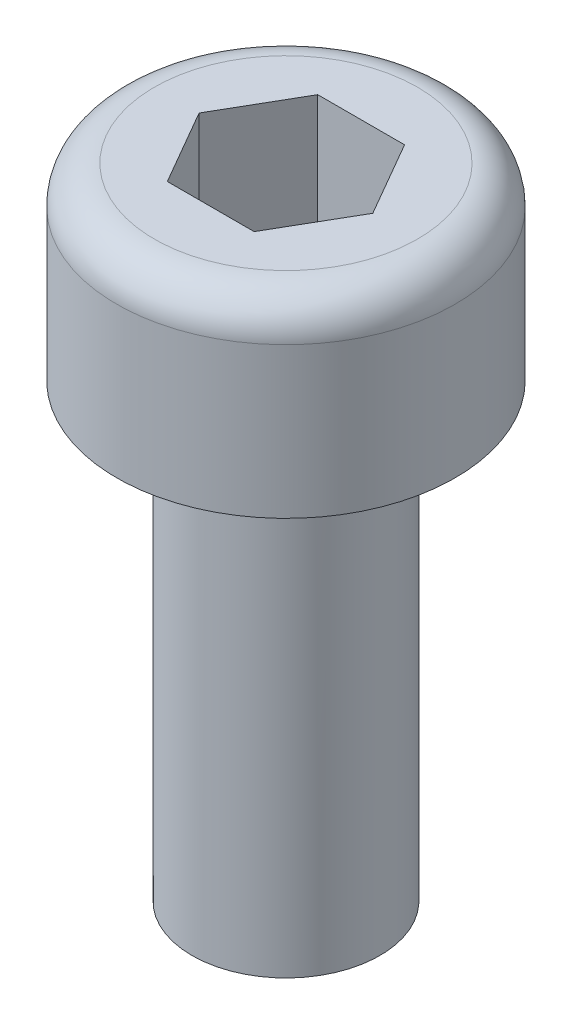
ISO-10303-21;
HEADER;
FILE_DESCRIPTION(('STEP AP214'),'2;1');
FILE_NAME('part.step','',(''),(''),'','','');
FILE_SCHEMA(('AUTOMOTIVE_DESIGN { 1 0 10303 214 1 1 1 1 }'));
ENDSEC;
DATA;
#1=APPLICATION_CONTEXT('core data for automotive mechanical design processes');
#2=APPLICATION_PROTOCOL_DEFINITION('international standard','automotive_design',2000,#1);
#3=PRODUCT_CONTEXT('',#1,'mechanical');
#4=PRODUCT('Part','Part','',(#3));
#5=PRODUCT_RELATED_PRODUCT_CATEGORY('part','',(#4));
#6=PRODUCT_DEFINITION_FORMATION('','',#4);
#7=PRODUCT_DEFINITION_CONTEXT('part definition',#1,'design');
#8=PRODUCT_DEFINITION('design','',#6,#7);
#9=PRODUCT_DEFINITION_SHAPE('','',#8);
#10=(LENGTH_UNIT() NAMED_UNIT(*) SI_UNIT(.MILLI.,.METRE.));
#11=(NAMED_UNIT(*) PLANE_ANGLE_UNIT() SI_UNIT($,.RADIAN.));
#12=(NAMED_UNIT(*) SI_UNIT($,.STERADIAN.) SOLID_ANGLE_UNIT());
#13=UNCERTAINTY_MEASURE_WITH_UNIT(LENGTH_MEASURE(1.E-05),#10,'distance_accuracy_value','');
#14=(GEOMETRIC_REPRESENTATION_CONTEXT(3) GLOBAL_UNCERTAINTY_ASSIGNED_CONTEXT((#13)) GLOBAL_UNIT_ASSIGNED_CONTEXT((#10,
#11,#12)) REPRESENTATION_CONTEXT('',''));
#15=CARTESIAN_POINT('',(0.,0.,0.));
#16=DIRECTION('',(0.,0.,1.));
#17=DIRECTION('',(1.,0.,0.));
#18=AXIS2_PLACEMENT_3D('',#15,#16,#17);
#19=CARTESIAN_POINT('',(0.,2.,0.));
#20=DIRECTION('',(0.,-1.00000000000001,0.));
#21=DIRECTION('',(0.,0.,-0.999999999999998));
#22=AXIS2_PLACEMENT_3D('',#19,#20,#21);
#23=TOROIDAL_SURFACE('',#22,1.75,0.5);
#24=CARTESIAN_POINT('',(0.,2.5,0.));
#25=DIRECTION('',(0.,-1.00000000000001,0.));
#26=DIRECTION('',(0.,0.,-0.999999999999998));
#27=AXIS2_PLACEMENT_3D('',#24,#25,#26);
#28=CIRCLE('',#27,1.75);
#29=CARTESIAN_POINT('',(0.,2.5,-1.75));
#30=VERTEX_POINT('',#29);
#31=EDGE_CURVE('E136',#30,#30,#28,.T.);
#32=ORIENTED_EDGE('',*,*,#31,.T.);
#33=EDGE_LOOP('',(#32));
#34=FACE_BOUND('',#33,.T.);
#35=CARTESIAN_POINT('',(0.,2.,0.));
#36=DIRECTION('',(0.,-1.00000000000001,0.));
#37=DIRECTION('',(0.,0.,-0.999999999999998));
#38=AXIS2_PLACEMENT_3D('',#35,#36,#37);
#39=CIRCLE('',#38,2.25);
#40=CARTESIAN_POINT('',(0.,2.,-2.24999999999999));
#41=VERTEX_POINT('',#40);
#42=EDGE_CURVE('E11',#41,#41,#39,.T.);
#43=ORIENTED_EDGE('',*,*,#42,.F.);
#44=EDGE_LOOP('',(#43));
#45=FACE_BOUND('',#44,.T.);
#46=ADVANCED_FACE('F33',(#34,#45),#23,.T.);
#47=CARTESIAN_POINT('',(0.,2.5,0.));
#48=DIRECTION('',(0.,-1.00000000000001,0.));
#49=DIRECTION('',(0.,0.,-0.999999999999998));
#50=AXIS2_PLACEMENT_3D('',#47,#48,#49);
#51=CYLINDRICAL_SURFACE('',#50,2.25);
#52=ORIENTED_EDGE('',*,*,#42,.T.);
#53=EDGE_LOOP('',(#52));
#54=FACE_BOUND('',#53,.T.);
#55=CARTESIAN_POINT('',(0.,0.,0.));
#56=DIRECTION('',(0.,-1.00000000000001,0.));
#57=DIRECTION('',(0.,0.,-0.999999999999998));
#58=AXIS2_PLACEMENT_3D('',#55,#56,#57);
#59=CIRCLE('',#58,2.25);
#60=CARTESIAN_POINT('',(0.,0.,-2.24999999999999));
#61=VERTEX_POINT('',#60);
#62=EDGE_CURVE('E40',#61,#61,#59,.T.);
#63=ORIENTED_EDGE('',*,*,#62,.F.);
#64=EDGE_LOOP('',(#63));
#65=FACE_BOUND('',#64,.T.);
#66=ADVANCED_FACE('F156',(#54,#65),#51,.T.);
#67=CARTESIAN_POINT('',(2.24999999999999,0.,0.));
#68=DIRECTION('',(0.,-1.00000000000001,0.));
#69=DIRECTION('',(0.,0.,-0.999999999999998));
#70=AXIS2_PLACEMENT_3D('',#67,#68,#69);
#71=PLANE('',#70);
#72=ORIENTED_EDGE('',*,*,#62,.T.);
#73=EDGE_LOOP('',(#72));
#74=FACE_BOUND('',#73,.T.);
#75=CARTESIAN_POINT('',(0.,0.,0.));
#76=DIRECTION('',(0.,-1.00000000000001,0.));
#77=DIRECTION('',(0.,0.,-0.999999999999998));
#78=AXIS2_PLACEMENT_3D('',#75,#76,#77);
#79=CIRCLE('',#78,1.25);
#80=CARTESIAN_POINT('',(0.,0.,-1.25));
#81=VERTEX_POINT('',#80);
#82=EDGE_CURVE('E148',#81,#81,#79,.T.);
#83=ORIENTED_EDGE('',*,*,#82,.F.);
#84=EDGE_LOOP('',(#83));
#85=FACE_BOUND('',#84,.T.);
#86=ADVANCED_FACE('F153',(#74,#85),#71,.T.);
#87=CARTESIAN_POINT('',(0.,2.5,0.));
#88=DIRECTION('',(0.,-1.00000000000001,0.));
#89=DIRECTION('',(0.,0.,-0.999999999999998));
#90=AXIS2_PLACEMENT_3D('',#87,#88,#89);
#91=CYLINDRICAL_SURFACE('',#90,1.25);
#92=ORIENTED_EDGE('',*,*,#82,.T.);
#93=EDGE_LOOP('',(#92));
#94=FACE_BOUND('',#93,.T.);
#95=CARTESIAN_POINT('',(0.,-6.00000000000014,0.));
#96=DIRECTION('',(0.,-1.00000000000001,0.));
#97=DIRECTION('',(0.,0.,-0.999999999999998));
#98=AXIS2_PLACEMENT_3D('',#95,#96,#97);
#99=CIRCLE('',#98,1.25);
#100=CARTESIAN_POINT('',(0.,-6.00000000000014,-1.25));
#101=VERTEX_POINT('',#100);
#102=EDGE_CURVE('E145',#101,#101,#99,.T.);
#103=ORIENTED_EDGE('',*,*,#102,.F.);
#104=EDGE_LOOP('',(#103));
#105=FACE_BOUND('',#104,.T.);
#106=ADVANCED_FACE('F163',(#94,#105),#91,.T.);
#107=CARTESIAN_POINT('',(0.,-6.33493649053905,0.));
#108=DIRECTION('',(0.,1.00000000000001,0.));
#109=DIRECTION('',(0.,0.,0.999999999999998));
#110=AXIS2_PLACEMENT_3D('',#107,#108,#109);
#111=CONICAL_SURFACE('',#110,0.,1.30899693899574);
#112=ORIENTED_EDGE('',*,*,#102,.T.);
#113=EDGE_LOOP('',(#112));
#114=FACE_BOUND('',#113,.T.);
#115=CARTESIAN_POINT('',(0.,-6.33493649053905,0.));
#116=VERTEX_POINT('',#115);
#117=VERTEX_LOOP('',#116);
#118=FACE_BOUND('',#117,.T.);
#119=ADVANCED_FACE('F169',(#114,#118),#111,.T.);
#120=CARTESIAN_POINT('',(0.,2.5,0.));
#121=DIRECTION('',(0.,1.00000000000001,0.));
#122=DIRECTION('',(0.,0.,0.999999999999998));
#123=AXIS2_PLACEMENT_3D('',#120,#121,#122);
#124=PLANE('',#123);
#125=DIRECTION('',(0.499999999999995,0.,-0.866025403784436));
#126=VECTOR('',#125,1.);
#127=CARTESIAN_POINT('',(0.577350269189604,2.5,0.999999999999985));
#128=LINE('',#127,#126);
#129=CARTESIAN_POINT('',(0.577350269189604,2.5,0.999999999999985));
#130=VERTEX_POINT('',#129);
#131=CARTESIAN_POINT('',(1.15470053837922,2.5,0.));
#132=VERTEX_POINT('',#131);
#133=EDGE_CURVE('E47',#130,#132,#128,.T.);
#134=ORIENTED_EDGE('',*,*,#133,.F.);
#135=DIRECTION('',(0.999999999999996,0.,0.));
#136=VECTOR('',#135,1.);
#137=CARTESIAN_POINT('',(-0.577350269189626,2.5,0.999999999999999));
#138=LINE('',#137,#136);
#139=CARTESIAN_POINT('',(-0.577350269189626,2.5,0.999999999999999));
#140=VERTEX_POINT('',#139);
#141=EDGE_CURVE('E116',#140,#130,#138,.T.);
#142=ORIENTED_EDGE('',*,*,#141,.F.);
#143=DIRECTION('',(0.5,0.,0.866025403784439));
#144=VECTOR('',#143,1.);
#145=CARTESIAN_POINT('',(-1.15470053837928,2.5,0.));
#146=LINE('',#145,#144);
#147=CARTESIAN_POINT('',(-1.15470053837928,2.5,0.));
#148=VERTEX_POINT('',#147);
#149=EDGE_CURVE('E110',#148,#140,#146,.T.);
#150=ORIENTED_EDGE('',*,*,#149,.F.);
#151=DIRECTION('',(-0.499999999999995,0.,0.866025403784436));
#152=VECTOR('',#151,1.);
#153=CARTESIAN_POINT('',(-0.577350269189626,2.5,-0.999999999999999));
#154=LINE('',#153,#152);
#155=CARTESIAN_POINT('',(-0.577350269189626,2.5,-0.999999999999999));
#156=VERTEX_POINT('',#155);
#157=EDGE_CURVE('E108',#156,#148,#154,.T.);
#158=ORIENTED_EDGE('',*,*,#157,.F.);
#159=DIRECTION('',(-0.999999999999996,0.,0.));
#160=VECTOR('',#159,1.);
#161=CARTESIAN_POINT('',(0.577350269189605,2.5,-1.));
#162=LINE('',#161,#160);
#163=CARTESIAN_POINT('',(0.577350269189605,2.5,-1.));
#164=VERTEX_POINT('',#163);
#165=EDGE_CURVE('E89',#164,#156,#162,.T.);
#166=ORIENTED_EDGE('',*,*,#165,.F.);
#167=DIRECTION('',(-0.5,0.,-0.866025403784438));
#168=VECTOR('',#167,1.);
#169=CARTESIAN_POINT('',(1.15470053837922,2.5,0.));
#170=LINE('',#169,#168);
#171=EDGE_CURVE('E100',#132,#164,#170,.T.);
#172=ORIENTED_EDGE('',*,*,#171,.F.);
#173=EDGE_LOOP('',(#134,#142,#150,#158,#166,#172));
#174=FACE_BOUND('',#173,.T.);
#175=ORIENTED_EDGE('',*,*,#31,.F.);
#176=EDGE_LOOP('',(#175));
#177=FACE_BOUND('',#176,.T.);
#178=ADVANCED_FACE('F104',(#174,#177),#124,.T.);
#179=CARTESIAN_POINT('',(0.577350269189628,0.5,0.999999999999966));
#180=DIRECTION('',(0.866025403784438,0.,0.500000000000002));
#181=DIRECTION('',(0.499999999999996,0.,-0.866025403784437));
#182=AXIS2_PLACEMENT_3D('',#179,#180,#181);
#183=PLANE('',#182);
#184=ORIENTED_EDGE('',*,*,#133,.T.);
#185=DIRECTION('',(0.,1.00000000000001,0.));
#186=VECTOR('',#185,1.);
#187=CARTESIAN_POINT('',(1.15470053837922,0.5,0.));
#188=LINE('',#187,#186);
#189=CARTESIAN_POINT('',(1.15470053837922,0.5,0.));
#190=VERTEX_POINT('',#189);
#191=EDGE_CURVE('E97',#190,#132,#188,.T.);
#192=ORIENTED_EDGE('',*,*,#191,.F.);
#193=DIRECTION('',(0.499999999999995,0.,-0.866025403784436));
#194=VECTOR('',#193,1.);
#195=CARTESIAN_POINT('',(0.577350269189628,0.5,0.999999999999966));
#196=LINE('',#195,#194);
#197=CARTESIAN_POINT('',(0.577350269189628,0.5,0.999999999999966));
#198=VERTEX_POINT('',#197);
#199=EDGE_CURVE('E119',#198,#190,#196,.T.);
#200=ORIENTED_EDGE('',*,*,#199,.F.);
#201=DIRECTION('',(0.,1.00000000000001,0.));
#202=VECTOR('',#201,1.);
#203=CARTESIAN_POINT('',(0.577350269189628,0.5,0.999999999999966));
#204=LINE('',#203,#202);
#205=EDGE_CURVE('E134',#198,#130,#204,.T.);
#206=ORIENTED_EDGE('',*,*,#205,.T.);
#207=EDGE_LOOP('',(#184,#192,#200,#206));
#208=FACE_BOUND('',#207,.T.);
#209=ADVANCED_FACE('F176',(#208),#183,.F.);
#210=CARTESIAN_POINT('',(-0.577350269189626,0.5,0.999999999999999));
#211=DIRECTION('',(0.,0.,0.999999999999997));
#212=DIRECTION('',(0.999999999999996,0.,0.));
#213=AXIS2_PLACEMENT_3D('',#210,#211,#212);
#214=PLANE('',#213);
#215=ORIENTED_EDGE('',*,*,#141,.T.);
#216=ORIENTED_EDGE('',*,*,#205,.F.);
#217=DIRECTION('',(0.999999999999996,0.,0.));
#218=VECTOR('',#217,1.);
#219=CARTESIAN_POINT('',(-0.577350269189626,0.5,0.999999999999999));
#220=LINE('',#219,#218);
#221=CARTESIAN_POINT('',(-0.577350269189626,0.5,0.999999999999999));
#222=VERTEX_POINT('',#221);
#223=EDGE_CURVE('E131',#222,#198,#220,.T.);
#224=ORIENTED_EDGE('',*,*,#223,.F.);
#225=DIRECTION('',(0.,1.00000000000001,0.));
#226=VECTOR('',#225,1.);
#227=CARTESIAN_POINT('',(-0.577350269189626,0.5,0.999999999999999));
#228=LINE('',#227,#226);
#229=EDGE_CURVE('E137',#222,#140,#228,.T.);
#230=ORIENTED_EDGE('',*,*,#229,.T.);
#231=EDGE_LOOP('',(#215,#216,#224,#230));
#232=FACE_BOUND('',#231,.T.);
#233=ADVANCED_FACE('F179',(#232),#214,.F.);
#234=CARTESIAN_POINT('',(-1.15470053837929,0.5,0.));
#235=DIRECTION('',(-0.866025403784435,0.,0.499999999999996));
#236=DIRECTION('',(0.5,0.,0.866025403784439));
#237=AXIS2_PLACEMENT_3D('',#234,#235,#236);
#238=PLANE('',#237);
#239=ORIENTED_EDGE('',*,*,#149,.T.);
#240=ORIENTED_EDGE('',*,*,#229,.F.);
#241=DIRECTION('',(0.5,0.,0.866025403784439));
#242=VECTOR('',#241,1.);
#243=CARTESIAN_POINT('',(-1.15470053837929,0.5,0.));
#244=LINE('',#243,#242);
#245=CARTESIAN_POINT('',(-1.15470053837929,0.5,0.));
#246=VERTEX_POINT('',#245);
#247=EDGE_CURVE('E128',#246,#222,#244,.T.);
#248=ORIENTED_EDGE('',*,*,#247,.F.);
#249=DIRECTION('',(0.,1.00000000000001,0.));
#250=VECTOR('',#249,1.);
#251=CARTESIAN_POINT('',(-1.15470053837929,0.5,0.));
#252=LINE('',#251,#250);
#253=EDGE_CURVE('E139',#246,#148,#252,.T.);
#254=ORIENTED_EDGE('',*,*,#253,.T.);
#255=EDGE_LOOP('',(#239,#240,#248,#254));
#256=FACE_BOUND('',#255,.T.);
#257=ADVANCED_FACE('F188',(#256),#238,.F.);
#258=CARTESIAN_POINT('',(-0.577350269189625,0.5,-1.));
#259=DIRECTION('',(-0.866025403784438,0.,-0.500000000000002));
#260=DIRECTION('',(-0.499999999999995,0.,0.866025403784436));
#261=AXIS2_PLACEMENT_3D('',#258,#259,#260);
#262=PLANE('',#261);
#263=ORIENTED_EDGE('',*,*,#157,.T.);
#264=ORIENTED_EDGE('',*,*,#253,.F.);
#265=DIRECTION('',(-0.499999999999995,0.,0.866025403784436));
#266=VECTOR('',#265,1.);
#267=CARTESIAN_POINT('',(-0.577350269189625,0.5,-1.));
#268=LINE('',#267,#266);
#269=CARTESIAN_POINT('',(-0.577350269189625,0.5,-1.));
#270=VERTEX_POINT('',#269);
#271=EDGE_CURVE('E125',#270,#246,#268,.T.);
#272=ORIENTED_EDGE('',*,*,#271,.F.);
#273=DIRECTION('',(0.,1.00000000000001,0.));
#274=VECTOR('',#273,1.);
#275=CARTESIAN_POINT('',(-0.577350269189625,0.5,-1.));
#276=LINE('',#275,#274);
#277=EDGE_CURVE('E96',#270,#156,#276,.T.);
#278=ORIENTED_EDGE('',*,*,#277,.T.);
#279=EDGE_LOOP('',(#263,#264,#272,#278));
#280=FACE_BOUND('',#279,.T.);
#281=ADVANCED_FACE('F185',(#280),#262,.F.);
#282=CARTESIAN_POINT('',(0.577350269189605,0.5,-1.));
#283=DIRECTION('',(0.,0.,-0.999999999999997));
#284=DIRECTION('',(-0.999999999999996,0.,0.));
#285=AXIS2_PLACEMENT_3D('',#282,#283,#284);
#286=PLANE('',#285);
#287=ORIENTED_EDGE('',*,*,#165,.T.);
#288=ORIENTED_EDGE('',*,*,#277,.F.);
#289=DIRECTION('',(-0.999999999999996,0.,0.));
#290=VECTOR('',#289,1.);
#291=CARTESIAN_POINT('',(0.577350269189605,0.5,-1.));
#292=LINE('',#291,#290);
#293=CARTESIAN_POINT('',(0.577350269189605,0.5,-1.));
#294=VERTEX_POINT('',#293);
#295=EDGE_CURVE('E92',#294,#270,#292,.T.);
#296=ORIENTED_EDGE('',*,*,#295,.F.);
#297=DIRECTION('',(0.,1.00000000000001,0.));
#298=VECTOR('',#297,1.);
#299=CARTESIAN_POINT('',(0.577350269189605,0.5,-1.));
#300=LINE('',#299,#298);
#301=EDGE_CURVE('E85',#294,#164,#300,.T.);
#302=ORIENTED_EDGE('',*,*,#301,.T.);
#303=EDGE_LOOP('',(#287,#288,#296,#302));
#304=FACE_BOUND('',#303,.T.);
#305=ADVANCED_FACE('F87',(#304),#286,.F.);
#306=CARTESIAN_POINT('',(1.15470053837922,0.5,0.));
#307=DIRECTION('',(0.866025403784435,0.,-0.499999999999996));
#308=DIRECTION('',(-0.5,0.,-0.866025403784439));
#309=AXIS2_PLACEMENT_3D('',#306,#307,#308);
#310=PLANE('',#309);
#311=ORIENTED_EDGE('',*,*,#171,.T.);
#312=ORIENTED_EDGE('',*,*,#301,.F.);
#313=DIRECTION('',(-0.5,0.,-0.866025403784438));
#314=VECTOR('',#313,1.);
#315=CARTESIAN_POINT('',(1.15470053837922,0.5,0.));
#316=LINE('',#315,#314);
#317=EDGE_CURVE('E122',#190,#294,#316,.T.);
#318=ORIENTED_EDGE('',*,*,#317,.F.);
#319=ORIENTED_EDGE('',*,*,#191,.T.);
#320=EDGE_LOOP('',(#311,#312,#318,#319));
#321=FACE_BOUND('',#320,.T.);
#322=ADVANCED_FACE('F101',(#321),#310,.F.);
#323=CARTESIAN_POINT('',(1.73205080756887,0.5,-1.00000000000001));
#324=DIRECTION('',(0.,1.00000000000001,0.));
#325=DIRECTION('',(0.,0.,0.999999999999998));
#326=AXIS2_PLACEMENT_3D('',#323,#324,#325);
#327=PLANE('',#326);
#328=ORIENTED_EDGE('',*,*,#199,.T.);
#329=ORIENTED_EDGE('',*,*,#317,.T.);
#330=ORIENTED_EDGE('',*,*,#295,.T.);
#331=ORIENTED_EDGE('',*,*,#271,.T.);
#332=ORIENTED_EDGE('',*,*,#247,.T.);
#333=ORIENTED_EDGE('',*,*,#223,.T.);
#334=EDGE_LOOP('',(#328,#329,#330,#331,#332,#333));
#335=FACE_BOUND('',#334,.T.);
#336=ADVANCED_FACE('F182',(#335),#327,.T.);
#337=CLOSED_SHELL('',(#46,#66,#86,#106,#119,#178,#209,#233,#257,#281,#305,#322,#336));
#338=MANIFOLD_SOLID_BREP('B2',#337);
#339=ADVANCED_BREP_SHAPE_REPRESENTATION('',(#18,#338),#14);
#340=SHAPE_DEFINITION_REPRESENTATION(#9,#339);
ENDSEC;
END-ISO-10303-21;
